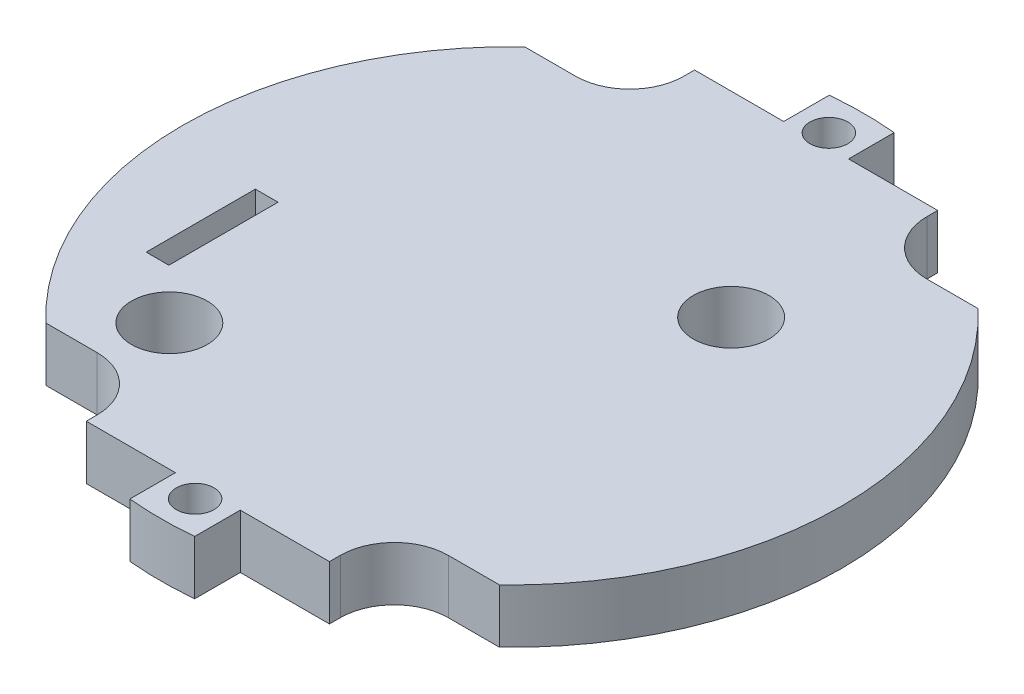
ISO-10303-21;
HEADER;
FILE_DESCRIPTION(('STEP AP214'),'2;1');
FILE_NAME('part.step','',(''),(''),'','','');
FILE_SCHEMA(('AUTOMOTIVE_DESIGN { 1 0 10303 214 1 1 1 1 }'));
ENDSEC;
DATA;
#1=APPLICATION_CONTEXT('core data for automotive mechanical design processes');
#2=APPLICATION_PROTOCOL_DEFINITION('international standard','automotive_design',2000,#1);
#3=PRODUCT_CONTEXT('',#1,'mechanical');
#4=PRODUCT('Part','Part','',(#3));
#5=PRODUCT_RELATED_PRODUCT_CATEGORY('part','',(#4));
#6=PRODUCT_DEFINITION_FORMATION('','',#4);
#7=PRODUCT_DEFINITION_CONTEXT('part definition',#1,'design');
#8=PRODUCT_DEFINITION('design','',#6,#7);
#9=PRODUCT_DEFINITION_SHAPE('','',#8);
#10=(LENGTH_UNIT() NAMED_UNIT(*) SI_UNIT(.MILLI.,.METRE.));
#11=(NAMED_UNIT(*) PLANE_ANGLE_UNIT() SI_UNIT($,.RADIAN.));
#12=(NAMED_UNIT(*) SI_UNIT($,.STERADIAN.) SOLID_ANGLE_UNIT());
#13=UNCERTAINTY_MEASURE_WITH_UNIT(LENGTH_MEASURE(1.E-05),#10,'distance_accuracy_value','');
#14=(GEOMETRIC_REPRESENTATION_CONTEXT(3) GLOBAL_UNCERTAINTY_ASSIGNED_CONTEXT((#13)) GLOBAL_UNIT_ASSIGNED_CONTEXT((#10,
#11,#12)) REPRESENTATION_CONTEXT('',''));
#15=CARTESIAN_POINT('',(0.,0.,0.));
#16=DIRECTION('',(0.,0.,1.));
#17=DIRECTION('',(1.,0.,0.));
#18=AXIS2_PLACEMENT_3D('',#15,#16,#17);
#19=CARTESIAN_POINT('',(0.,5.,22.1412422505688));
#20=DIRECTION('',(0.,0.,-1.));
#21=DIRECTION('',(-1.,0.,0.));
#22=AXIS2_PLACEMENT_3D('',#19,#20,#21);
#23=PLANE('',#22);
#24=DIRECTION('',(1.,0.,0.));
#25=VECTOR('',#24,1.);
#26=CARTESIAN_POINT('',(0.,0.,22.1412422505688));
#27=LINE('',#26,#25);
#28=CARTESIAN_POINT('',(-20.9765438431031,0.,22.1412422505688));
#29=VERTEX_POINT('',#28);
#30=CARTESIAN_POINT('',(-16.25,0.,22.1412422505688));
#31=VERTEX_POINT('',#30);
#32=EDGE_CURVE('E314',#29,#31,#27,.T.);
#33=ORIENTED_EDGE('',*,*,#32,.T.);
#34=DIRECTION('',(0.,-1.,0.));
#35=VECTOR('',#34,1.);
#36=CARTESIAN_POINT('',(-16.25,5.,22.1412422505688));
#37=LINE('',#36,#35);
#38=CARTESIAN_POINT('',(-16.25,5.,22.1412422505688));
#39=VERTEX_POINT('',#38);
#40=EDGE_CURVE('E416',#31,#39,#37,.F.);
#41=ORIENTED_EDGE('',*,*,#40,.T.);
#42=DIRECTION('',(1.,0.,0.));
#43=VECTOR('',#42,1.);
#44=CARTESIAN_POINT('',(0.,5.,22.1412422505688));
#45=LINE('',#44,#43);
#46=CARTESIAN_POINT('',(-20.9765438431031,5.,22.1412422505688));
#47=VERTEX_POINT('',#46);
#48=EDGE_CURVE('E258',#47,#39,#45,.T.);
#49=ORIENTED_EDGE('',*,*,#48,.F.);
#50=DIRECTION('',(0.,-1.,0.));
#51=VECTOR('',#50,1.);
#52=CARTESIAN_POINT('',(-20.9765438431031,5.,22.1412422505688));
#53=LINE('',#52,#51);
#54=EDGE_CURVE('E313',#47,#29,#53,.T.);
#55=ORIENTED_EDGE('',*,*,#54,.T.);
#56=EDGE_LOOP('',(#33,#41,#49,#55));
#57=FACE_BOUND('',#56,.T.);
#58=ADVANCED_FACE('F35',(#57),#23,.F.);
#59=CARTESIAN_POINT('',(-11.25,5.,0.));
#60=DIRECTION('',(-1.,0.,0.));
#61=DIRECTION('',(0.,0.,1.));
#62=AXIS2_PLACEMENT_3D('',#59,#60,#61);
#63=PLANE('',#62);
#64=DIRECTION('',(0.,0.,-1.));
#65=VECTOR('',#64,1.);
#66=CARTESIAN_POINT('',(-11.25,5.,0.));
#67=LINE('',#66,#65);
#68=CARTESIAN_POINT('',(-11.25,5.,28.1412422505688));
#69=VERTEX_POINT('',#68);
#70=CARTESIAN_POINT('',(-11.25,5.,27.1412422505688));
#71=VERTEX_POINT('',#70);
#72=EDGE_CURVE('E261',#69,#71,#67,.T.);
#73=ORIENTED_EDGE('',*,*,#72,.T.);
#74=DIRECTION('',(0.,-1.,0.));
#75=VECTOR('',#74,1.);
#76=CARTESIAN_POINT('',(-11.25,5.,27.1412422505688));
#77=LINE('',#76,#75);
#78=CARTESIAN_POINT('',(-11.25,0.,27.1412422505688));
#79=VERTEX_POINT('',#78);
#80=EDGE_CURVE('E413',#71,#79,#77,.T.);
#81=ORIENTED_EDGE('',*,*,#80,.T.);
#82=DIRECTION('',(0.,0.,-1.));
#83=VECTOR('',#82,1.);
#84=CARTESIAN_POINT('',(-11.25,0.,0.));
#85=LINE('',#84,#83);
#86=CARTESIAN_POINT('',(-11.25,0.,28.1412422505688));
#87=VERTEX_POINT('',#86);
#88=EDGE_CURVE('E317',#87,#79,#85,.T.);
#89=ORIENTED_EDGE('',*,*,#88,.F.);
#90=DIRECTION('',(0.,-1.,0.));
#91=VECTOR('',#90,1.);
#92=CARTESIAN_POINT('',(-11.25,5.,28.1412422505688));
#93=LINE('',#92,#91);
#94=EDGE_CURVE('E406',#69,#87,#93,.T.);
#95=ORIENTED_EDGE('',*,*,#94,.F.);
#96=EDGE_LOOP('',(#73,#81,#89,#95));
#97=FACE_BOUND('',#96,.T.);
#98=ADVANCED_FACE('F511',(#97),#63,.T.);
#99=CARTESIAN_POINT('',(0.,5.,28.1412422505688));
#100=DIRECTION('',(0.,0.,1.));
#101=DIRECTION('',(1.,0.,0.));
#102=AXIS2_PLACEMENT_3D('',#99,#100,#101);
#103=PLANE('',#102);
#104=DIRECTION('',(-1.,0.,0.));
#105=VECTOR('',#104,1.);
#106=CARTESIAN_POINT('',(0.,0.,28.1412422505688));
#107=LINE('',#106,#105);
#108=CARTESIAN_POINT('',(-2.99999999999999,0.,28.1412422505688));
#109=VERTEX_POINT('',#108);
#110=EDGE_CURVE('E322',#109,#87,#107,.T.);
#111=ORIENTED_EDGE('',*,*,#110,.F.);
#112=DIRECTION('',(0.,-1.,0.));
#113=VECTOR('',#112,1.);
#114=CARTESIAN_POINT('',(-2.99999999999999,5.,28.1412422505688));
#115=LINE('',#114,#113);
#116=CARTESIAN_POINT('',(-2.99999999999999,5.,28.1412422505688));
#117=VERTEX_POINT('',#116);
#118=EDGE_CURVE('E404',#117,#109,#115,.T.);
#119=ORIENTED_EDGE('',*,*,#118,.F.);
#120=DIRECTION('',(-1.,0.,0.));
#121=VECTOR('',#120,1.);
#122=CARTESIAN_POINT('',(0.,5.,28.1412422505688));
#123=LINE('',#122,#121);
#124=EDGE_CURVE('E266',#117,#69,#123,.T.);
#125=ORIENTED_EDGE('',*,*,#124,.T.);
#126=ORIENTED_EDGE('',*,*,#94,.T.);
#127=EDGE_LOOP('',(#111,#119,#125,#126));
#128=FACE_BOUND('',#127,.T.);
#129=ADVANCED_FACE('F516',(#128),#103,.T.);
#130=CARTESIAN_POINT('',(-3.,5.,0.));
#131=DIRECTION('',(-1.,0.,0.));
#132=DIRECTION('',(0.,0.,1.));
#133=AXIS2_PLACEMENT_3D('',#130,#131,#132);
#134=PLANE('',#133);
#135=DIRECTION('',(0.,0.,-1.));
#136=VECTOR('',#135,1.);
#137=CARTESIAN_POINT('',(-3.,0.,0.));
#138=LINE('',#137,#136);
#139=CARTESIAN_POINT('',(-2.99999999999998,0.,32.3612422505688));
#140=VERTEX_POINT('',#139);
#141=EDGE_CURVE('E325',#140,#109,#138,.T.);
#142=ORIENTED_EDGE('',*,*,#141,.F.);
#143=DIRECTION('',(0.,-1.,0.));
#144=VECTOR('',#143,1.);
#145=CARTESIAN_POINT('',(-2.99999999999998,5.,32.3612422505688));
#146=LINE('',#145,#144);
#147=CARTESIAN_POINT('',(-2.99999999999998,5.,32.3612422505688));
#148=VERTEX_POINT('',#147);
#149=EDGE_CURVE('E402',#148,#140,#146,.T.);
#150=ORIENTED_EDGE('',*,*,#149,.F.);
#151=DIRECTION('',(0.,0.,-1.));
#152=VECTOR('',#151,1.);
#153=CARTESIAN_POINT('',(-3.,5.,0.));
#154=LINE('',#153,#152);
#155=EDGE_CURVE('E269',#148,#117,#154,.T.);
#156=ORIENTED_EDGE('',*,*,#155,.T.);
#157=ORIENTED_EDGE('',*,*,#118,.T.);
#158=EDGE_LOOP('',(#142,#150,#156,#157));
#159=FACE_BOUND('',#158,.T.);
#160=ADVANCED_FACE('F520',(#159),#134,.T.);
#161=CARTESIAN_POINT('',(0.,5.,0.));
#162=DIRECTION('',(0.,-1.,0.));
#163=DIRECTION('',(0.,0.,-1.));
#164=AXIS2_PLACEMENT_3D('',#161,#162,#163);
#165=CYLINDRICAL_SURFACE('',#164,32.5);
#166=CARTESIAN_POINT('',(0.,0.,0.));
#167=DIRECTION('',(0.,1.,0.));
#168=DIRECTION('',(0.,0.,1.));
#169=AXIS2_PLACEMENT_3D('',#166,#167,#168);
#170=CIRCLE('',#169,32.5);
#171=CARTESIAN_POINT('',(3.,0.,32.3612422505688));
#172=VERTEX_POINT('',#171);
#173=EDGE_CURVE('E328',#140,#172,#170,.T.);
#174=ORIENTED_EDGE('',*,*,#173,.T.);
#175=DIRECTION('',(0.,-1.,0.));
#176=VECTOR('',#175,1.);
#177=CARTESIAN_POINT('',(3.,5.,32.3612422505688));
#178=LINE('',#177,#176);
#179=CARTESIAN_POINT('',(3.,5.,32.3612422505688));
#180=VERTEX_POINT('',#179);
#181=EDGE_CURVE('E399',#180,#172,#178,.T.);
#182=ORIENTED_EDGE('',*,*,#181,.F.);
#183=CARTESIAN_POINT('',(0.,5.,0.));
#184=DIRECTION('',(0.,1.,0.));
#185=DIRECTION('',(0.,0.,1.));
#186=AXIS2_PLACEMENT_3D('',#183,#184,#185);
#187=CIRCLE('',#186,32.5);
#188=EDGE_CURVE('E272',#148,#180,#187,.T.);
#189=ORIENTED_EDGE('',*,*,#188,.F.);
#190=ORIENTED_EDGE('',*,*,#149,.T.);
#191=EDGE_LOOP('',(#174,#182,#189,#190));
#192=FACE_BOUND('',#191,.T.);
#193=ADVANCED_FACE('F524',(#192),#165,.T.);
#194=CARTESIAN_POINT('',(3.00000000000001,5.,0.));
#195=DIRECTION('',(-1.,0.,0.));
#196=DIRECTION('',(0.,0.,1.));
#197=AXIS2_PLACEMENT_3D('',#194,#195,#196);
#198=PLANE('',#197);
#199=DIRECTION('',(0.,0.,-1.));
#200=VECTOR('',#199,1.);
#201=CARTESIAN_POINT('',(3.00000000000001,0.,0.));
#202=LINE('',#201,#200);
#203=CARTESIAN_POINT('',(3.,0.,28.1412422505688));
#204=VERTEX_POINT('',#203);
#205=EDGE_CURVE('E330',#172,#204,#202,.T.);
#206=ORIENTED_EDGE('',*,*,#205,.T.);
#207=DIRECTION('',(0.,-1.,0.));
#208=VECTOR('',#207,1.);
#209=CARTESIAN_POINT('',(3.,5.,28.1412422505688));
#210=LINE('',#209,#208);
#211=CARTESIAN_POINT('',(3.,5.,28.1412422505688));
#212=VERTEX_POINT('',#211);
#213=EDGE_CURVE('E396',#212,#204,#210,.T.);
#214=ORIENTED_EDGE('',*,*,#213,.F.);
#215=DIRECTION('',(0.,0.,-1.));
#216=VECTOR('',#215,1.);
#217=CARTESIAN_POINT('',(3.00000000000001,5.,0.));
#218=LINE('',#217,#216);
#219=EDGE_CURVE('E274',#180,#212,#218,.T.);
#220=ORIENTED_EDGE('',*,*,#219,.F.);
#221=ORIENTED_EDGE('',*,*,#181,.T.);
#222=EDGE_LOOP('',(#206,#214,#220,#221));
#223=FACE_BOUND('',#222,.T.);
#224=ADVANCED_FACE('F530',(#223),#198,.F.);
#225=CARTESIAN_POINT('',(0.,5.,28.1412422505688));
#226=DIRECTION('',(0.,0.,-1.));
#227=DIRECTION('',(-1.,0.,0.));
#228=AXIS2_PLACEMENT_3D('',#225,#226,#227);
#229=PLANE('',#228);
#230=DIRECTION('',(1.,0.,0.));
#231=VECTOR('',#230,1.);
#232=CARTESIAN_POINT('',(0.,0.,28.1412422505688));
#233=LINE('',#232,#231);
#234=CARTESIAN_POINT('',(11.25,0.,28.1412422505688));
#235=VERTEX_POINT('',#234);
#236=EDGE_CURVE('E332',#204,#235,#233,.T.);
#237=ORIENTED_EDGE('',*,*,#236,.T.);
#238=DIRECTION('',(0.,-1.,0.));
#239=VECTOR('',#238,1.);
#240=CARTESIAN_POINT('',(11.25,5.,28.1412422505688));
#241=LINE('',#240,#239);
#242=CARTESIAN_POINT('',(11.25,5.,28.1412422505688));
#243=VERTEX_POINT('',#242);
#244=EDGE_CURVE('E393',#243,#235,#241,.T.);
#245=ORIENTED_EDGE('',*,*,#244,.F.);
#246=DIRECTION('',(1.,0.,0.));
#247=VECTOR('',#246,1.);
#248=CARTESIAN_POINT('',(0.,5.,28.1412422505688));
#249=LINE('',#248,#247);
#250=EDGE_CURVE('E276',#212,#243,#249,.T.);
#251=ORIENTED_EDGE('',*,*,#250,.F.);
#252=ORIENTED_EDGE('',*,*,#213,.T.);
#253=EDGE_LOOP('',(#237,#245,#251,#252));
#254=FACE_BOUND('',#253,.T.);
#255=ADVANCED_FACE('F534',(#254),#229,.F.);
#256=CARTESIAN_POINT('',(11.25,5.,0.));
#257=DIRECTION('',(-1.,0.,0.));
#258=DIRECTION('',(0.,0.,1.));
#259=AXIS2_PLACEMENT_3D('',#256,#257,#258);
#260=PLANE('',#259);
#261=DIRECTION('',(0.,0.,-1.));
#262=VECTOR('',#261,1.);
#263=CARTESIAN_POINT('',(11.25,0.,0.));
#264=LINE('',#263,#262);
#265=CARTESIAN_POINT('',(11.25,0.,27.1412422505688));
#266=VERTEX_POINT('',#265);
#267=EDGE_CURVE('E334',#235,#266,#264,.T.);
#268=ORIENTED_EDGE('',*,*,#267,.T.);
#269=DIRECTION('',(0.,-1.,0.));
#270=VECTOR('',#269,1.);
#271=CARTESIAN_POINT('',(11.25,5.,27.1412422505688));
#272=LINE('',#271,#270);
#273=CARTESIAN_POINT('',(11.25,5.,27.1412422505688));
#274=VERTEX_POINT('',#273);
#275=EDGE_CURVE('E411',#266,#274,#272,.F.);
#276=ORIENTED_EDGE('',*,*,#275,.T.);
#277=DIRECTION('',(0.,0.,-1.));
#278=VECTOR('',#277,1.);
#279=CARTESIAN_POINT('',(11.25,5.,0.));
#280=LINE('',#279,#278);
#281=EDGE_CURVE('E278',#243,#274,#280,.T.);
#282=ORIENTED_EDGE('',*,*,#281,.F.);
#283=ORIENTED_EDGE('',*,*,#244,.T.);
#284=EDGE_LOOP('',(#268,#276,#282,#283));
#285=FACE_BOUND('',#284,.T.);
#286=ADVANCED_FACE('F538',(#285),#260,.F.);
#287=CARTESIAN_POINT('',(16.25,5.,22.1412422505688));
#288=VERTEX_POINT('',#287);
#289=CARTESIAN_POINT('',(20.9765438431031,5.,22.1412422505688));
#290=VERTEX_POINT('',#289);
#291=EDGE_CURVE('E263',#288,#290,#45,.T.);
#292=ORIENTED_EDGE('',*,*,#291,.F.);
#293=DIRECTION('',(0.,-1.,0.));
#294=VECTOR('',#293,1.);
#295=CARTESIAN_POINT('',(16.25,0.,22.1412422505688));
#296=LINE('',#295,#294);
#297=CARTESIAN_POINT('',(16.25,0.,22.1412422505688));
#298=VERTEX_POINT('',#297);
#299=EDGE_CURVE('E408',#288,#298,#296,.T.);
#300=ORIENTED_EDGE('',*,*,#299,.T.);
#301=CARTESIAN_POINT('',(20.9765438431031,0.,22.1412422505688));
#302=VERTEX_POINT('',#301);
#303=EDGE_CURVE('E319',#298,#302,#27,.T.);
#304=ORIENTED_EDGE('',*,*,#303,.T.);
#305=DIRECTION('',(0.,-1.,0.));
#306=VECTOR('',#305,1.);
#307=CARTESIAN_POINT('',(20.9765438431031,5.,22.1412422505688));
#308=LINE('',#307,#306);
#309=EDGE_CURVE('E390',#290,#302,#308,.T.);
#310=ORIENTED_EDGE('',*,*,#309,.F.);
#311=EDGE_LOOP('',(#292,#300,#304,#310));
#312=FACE_BOUND('',#311,.T.);
#313=ADVANCED_FACE('F547',(#312),#23,.F.);
#314=CARTESIAN_POINT('',(0.,5.,0.));
#315=DIRECTION('',(0.,-1.,0.));
#316=DIRECTION('',(0.,0.,-1.));
#317=AXIS2_PLACEMENT_3D('',#314,#315,#316);
#318=CYLINDRICAL_SURFACE('',#317,30.5);
#319=CARTESIAN_POINT('',(0.,0.,0.));
#320=DIRECTION('',(0.,1.,0.));
#321=DIRECTION('',(0.,0.,1.));
#322=AXIS2_PLACEMENT_3D('',#319,#320,#321);
#323=CIRCLE('',#322,30.5);
#324=CARTESIAN_POINT('',(20.9765438431031,0.,-22.1412422505688));
#325=VERTEX_POINT('',#324);
#326=EDGE_CURVE('E337',#302,#325,#323,.T.);
#327=ORIENTED_EDGE('',*,*,#326,.T.);
#328=DIRECTION('',(0.,-1.,0.));
#329=VECTOR('',#328,1.);
#330=CARTESIAN_POINT('',(20.9765438431031,5.,-22.1412422505688));
#331=LINE('',#330,#329);
#332=CARTESIAN_POINT('',(20.9765438431031,5.,-22.1412422505688));
#333=VERTEX_POINT('',#332);
#334=EDGE_CURVE('E387',#333,#325,#331,.T.);
#335=ORIENTED_EDGE('',*,*,#334,.F.);
#336=CARTESIAN_POINT('',(0.,5.,0.));
#337=DIRECTION('',(0.,1.,0.));
#338=DIRECTION('',(0.,0.,1.));
#339=AXIS2_PLACEMENT_3D('',#336,#337,#338);
#340=CIRCLE('',#339,30.5);
#341=EDGE_CURVE('E281',#290,#333,#340,.T.);
#342=ORIENTED_EDGE('',*,*,#341,.F.);
#343=ORIENTED_EDGE('',*,*,#309,.T.);
#344=EDGE_LOOP('',(#327,#335,#342,#343));
#345=FACE_BOUND('',#344,.T.);
#346=ADVANCED_FACE('F550',(#345),#318,.T.);
#347=CARTESIAN_POINT('',(0.,5.,-22.1412422505688));
#348=DIRECTION('',(0.,0.,-1.));
#349=DIRECTION('',(-1.,0.,0.));
#350=AXIS2_PLACEMENT_3D('',#347,#348,#349);
#351=PLANE('',#350);
#352=DIRECTION('',(1.,0.,0.));
#353=VECTOR('',#352,1.);
#354=CARTESIAN_POINT('',(0.,0.,-22.1412422505688));
#355=LINE('',#354,#353);
#356=CARTESIAN_POINT('',(16.25,0.,-22.1412422505688));
#357=VERTEX_POINT('',#356);
#358=EDGE_CURVE('E340',#357,#325,#355,.T.);
#359=ORIENTED_EDGE('',*,*,#358,.F.);
#360=DIRECTION('',(0.,-1.,0.));
#361=VECTOR('',#360,1.);
#362=CARTESIAN_POINT('',(16.25,5.,-22.1412422505688));
#363=LINE('',#362,#361);
#364=CARTESIAN_POINT('',(16.25,5.,-22.1412422505688));
#365=VERTEX_POINT('',#364);
#366=EDGE_CURVE('E426',#357,#365,#363,.F.);
#367=ORIENTED_EDGE('',*,*,#366,.T.);
#368=DIRECTION('',(1.,0.,0.));
#369=VECTOR('',#368,1.);
#370=CARTESIAN_POINT('',(0.,5.,-22.1412422505688));
#371=LINE('',#370,#369);
#372=EDGE_CURVE('E284',#365,#333,#371,.T.);
#373=ORIENTED_EDGE('',*,*,#372,.T.);
#374=ORIENTED_EDGE('',*,*,#334,.T.);
#375=EDGE_LOOP('',(#359,#367,#373,#374));
#376=FACE_BOUND('',#375,.T.);
#377=ADVANCED_FACE('F448',(#376),#351,.T.);
#378=CARTESIAN_POINT('',(11.25,5.,0.));
#379=DIRECTION('',(1.,0.,0.));
#380=DIRECTION('',(0.,0.,-1.));
#381=AXIS2_PLACEMENT_3D('',#378,#379,#380);
#382=PLANE('',#381);
#383=DIRECTION('',(0.,0.,1.));
#384=VECTOR('',#383,1.);
#385=CARTESIAN_POINT('',(11.25,5.,0.));
#386=LINE('',#385,#384);
#387=CARTESIAN_POINT('',(11.25,5.,-28.1412422505688));
#388=VERTEX_POINT('',#387);
#389=CARTESIAN_POINT('',(11.25,5.,-27.1412422505688));
#390=VERTEX_POINT('',#389);
#391=EDGE_CURVE('E286',#388,#390,#386,.T.);
#392=ORIENTED_EDGE('',*,*,#391,.T.);
#393=DIRECTION('',(0.,-1.,0.));
#394=VECTOR('',#393,1.);
#395=CARTESIAN_POINT('',(11.25,0.,-27.1412422505688));
#396=LINE('',#395,#394);
#397=CARTESIAN_POINT('',(11.25,0.,-27.1412422505688));
#398=VERTEX_POINT('',#397);
#399=EDGE_CURVE('E423',#390,#398,#396,.T.);
#400=ORIENTED_EDGE('',*,*,#399,.T.);
#401=DIRECTION('',(0.,0.,1.));
#402=VECTOR('',#401,1.);
#403=CARTESIAN_POINT('',(11.25,0.,0.));
#404=LINE('',#403,#402);
#405=CARTESIAN_POINT('',(11.25,0.,-28.1412422505688));
#406=VERTEX_POINT('',#405);
#407=EDGE_CURVE('E342',#406,#398,#404,.T.);
#408=ORIENTED_EDGE('',*,*,#407,.F.);
#409=DIRECTION('',(0.,-1.,0.));
#410=VECTOR('',#409,1.);
#411=CARTESIAN_POINT('',(11.25,5.,-28.1412422505688));
#412=LINE('',#411,#410);
#413=EDGE_CURVE('E385',#388,#406,#412,.T.);
#414=ORIENTED_EDGE('',*,*,#413,.F.);
#415=EDGE_LOOP('',(#392,#400,#408,#414));
#416=FACE_BOUND('',#415,.T.);
#417=ADVANCED_FACE('F458',(#416),#382,.T.);
#418=CARTESIAN_POINT('',(0.,5.,-28.1412422505688));
#419=DIRECTION('',(0.,0.,-1.));
#420=DIRECTION('',(-1.,0.,0.));
#421=AXIS2_PLACEMENT_3D('',#418,#419,#420);
#422=PLANE('',#421);
#423=DIRECTION('',(1.,0.,0.));
#424=VECTOR('',#423,1.);
#425=CARTESIAN_POINT('',(0.,0.,-28.1412422505688));
#426=LINE('',#425,#424);
#427=CARTESIAN_POINT('',(3.,0.,-28.1412422505688));
#428=VERTEX_POINT('',#427);
#429=EDGE_CURVE('E346',#428,#406,#426,.T.);
#430=ORIENTED_EDGE('',*,*,#429,.F.);
#431=DIRECTION('',(0.,-1.,0.));
#432=VECTOR('',#431,1.);
#433=CARTESIAN_POINT('',(3.,5.,-28.1412422505688));
#434=LINE('',#433,#432);
#435=CARTESIAN_POINT('',(3.,5.,-28.1412422505688));
#436=VERTEX_POINT('',#435);
#437=EDGE_CURVE('E383',#436,#428,#434,.T.);
#438=ORIENTED_EDGE('',*,*,#437,.F.);
#439=DIRECTION('',(1.,0.,0.));
#440=VECTOR('',#439,1.);
#441=CARTESIAN_POINT('',(0.,5.,-28.1412422505688));
#442=LINE('',#441,#440);
#443=EDGE_CURVE('E290',#436,#388,#442,.T.);
#444=ORIENTED_EDGE('',*,*,#443,.T.);
#445=ORIENTED_EDGE('',*,*,#413,.T.);
#446=EDGE_LOOP('',(#430,#438,#444,#445));
#447=FACE_BOUND('',#446,.T.);
#448=ADVANCED_FACE('F461',(#447),#422,.T.);
#449=CARTESIAN_POINT('',(3.00000000000001,5.,0.));
#450=DIRECTION('',(1.,0.,0.));
#451=DIRECTION('',(0.,0.,-1.));
#452=AXIS2_PLACEMENT_3D('',#449,#450,#451);
#453=PLANE('',#452);
#454=DIRECTION('',(0.,0.,1.));
#455=VECTOR('',#454,1.);
#456=CARTESIAN_POINT('',(3.00000000000001,0.,0.));
#457=LINE('',#456,#455);
#458=CARTESIAN_POINT('',(3.,0.,-32.3612422505688));
#459=VERTEX_POINT('',#458);
#460=EDGE_CURVE('E349',#459,#428,#457,.T.);
#461=ORIENTED_EDGE('',*,*,#460,.F.);
#462=DIRECTION('',(0.,-1.,0.));
#463=VECTOR('',#462,1.);
#464=CARTESIAN_POINT('',(3.,5.,-32.3612422505688));
#465=LINE('',#464,#463);
#466=CARTESIAN_POINT('',(3.,5.,-32.3612422505688));
#467=VERTEX_POINT('',#466);
#468=EDGE_CURVE('E381',#467,#459,#465,.T.);
#469=ORIENTED_EDGE('',*,*,#468,.F.);
#470=DIRECTION('',(0.,0.,1.));
#471=VECTOR('',#470,1.);
#472=CARTESIAN_POINT('',(3.00000000000001,5.,0.));
#473=LINE('',#472,#471);
#474=EDGE_CURVE('E293',#467,#436,#473,.T.);
#475=ORIENTED_EDGE('',*,*,#474,.T.);
#476=ORIENTED_EDGE('',*,*,#437,.T.);
#477=EDGE_LOOP('',(#461,#469,#475,#476));
#478=FACE_BOUND('',#477,.T.);
#479=ADVANCED_FACE('F465',(#478),#453,.T.);
#480=CARTESIAN_POINT('',(0.,5.,0.));
#481=DIRECTION('',(0.,-1.,0.));
#482=DIRECTION('',(0.,0.,-1.));
#483=AXIS2_PLACEMENT_3D('',#480,#481,#482);
#484=CYLINDRICAL_SURFACE('',#483,32.5);
#485=CARTESIAN_POINT('',(0.,0.,0.));
#486=DIRECTION('',(0.,1.,0.));
#487=DIRECTION('',(0.,0.,1.));
#488=AXIS2_PLACEMENT_3D('',#485,#486,#487);
#489=CIRCLE('',#488,32.5);
#490=CARTESIAN_POINT('',(-2.99999999999998,0.,-32.3612422505688));
#491=VERTEX_POINT('',#490);
#492=EDGE_CURVE('E352',#459,#491,#489,.T.);
#493=ORIENTED_EDGE('',*,*,#492,.T.);
#494=DIRECTION('',(0.,-1.,0.));
#495=VECTOR('',#494,1.);
#496=CARTESIAN_POINT('',(-2.99999999999998,5.,-32.3612422505688));
#497=LINE('',#496,#495);
#498=CARTESIAN_POINT('',(-2.99999999999998,5.,-32.3612422505688));
#499=VERTEX_POINT('',#498);
#500=EDGE_CURVE('E378',#499,#491,#497,.T.);
#501=ORIENTED_EDGE('',*,*,#500,.F.);
#502=CARTESIAN_POINT('',(0.,5.,0.));
#503=DIRECTION('',(0.,1.,0.));
#504=DIRECTION('',(0.,0.,1.));
#505=AXIS2_PLACEMENT_3D('',#502,#503,#504);
#506=CIRCLE('',#505,32.5);
#507=EDGE_CURVE('E296',#467,#499,#506,.T.);
#508=ORIENTED_EDGE('',*,*,#507,.F.);
#509=ORIENTED_EDGE('',*,*,#468,.T.);
#510=EDGE_LOOP('',(#493,#501,#508,#509));
#511=FACE_BOUND('',#510,.T.);
#512=ADVANCED_FACE('F470',(#511),#484,.T.);
#513=CARTESIAN_POINT('',(-3.,5.,0.));
#514=DIRECTION('',(1.,0.,0.));
#515=DIRECTION('',(0.,0.,-1.));
#516=AXIS2_PLACEMENT_3D('',#513,#514,#515);
#517=PLANE('',#516);
#518=DIRECTION('',(0.,0.,1.));
#519=VECTOR('',#518,1.);
#520=CARTESIAN_POINT('',(-3.,0.,0.));
#521=LINE('',#520,#519);
#522=CARTESIAN_POINT('',(-2.99999999999999,0.,-28.1412422505688));
#523=VERTEX_POINT('',#522);
#524=EDGE_CURVE('E354',#491,#523,#521,.T.);
#525=ORIENTED_EDGE('',*,*,#524,.T.);
#526=DIRECTION('',(0.,-1.,0.));
#527=VECTOR('',#526,1.);
#528=CARTESIAN_POINT('',(-2.99999999999999,5.,-28.1412422505688));
#529=LINE('',#528,#527);
#530=CARTESIAN_POINT('',(-2.99999999999999,5.,-28.1412422505688));
#531=VERTEX_POINT('',#530);
#532=EDGE_CURVE('E375',#531,#523,#529,.T.);
#533=ORIENTED_EDGE('',*,*,#532,.F.);
#534=DIRECTION('',(0.,0.,1.));
#535=VECTOR('',#534,1.);
#536=CARTESIAN_POINT('',(-3.,5.,0.));
#537=LINE('',#536,#535);
#538=EDGE_CURVE('E298',#499,#531,#537,.T.);
#539=ORIENTED_EDGE('',*,*,#538,.F.);
#540=ORIENTED_EDGE('',*,*,#500,.T.);
#541=EDGE_LOOP('',(#525,#533,#539,#540));
#542=FACE_BOUND('',#541,.T.);
#543=ADVANCED_FACE('F476',(#542),#517,.F.);
#544=CARTESIAN_POINT('',(0.,5.,-28.1412422505688));
#545=DIRECTION('',(0.,0.,1.));
#546=DIRECTION('',(1.,0.,0.));
#547=AXIS2_PLACEMENT_3D('',#544,#545,#546);
#548=PLANE('',#547);
#549=DIRECTION('',(-1.,0.,0.));
#550=VECTOR('',#549,1.);
#551=CARTESIAN_POINT('',(0.,0.,-28.1412422505688));
#552=LINE('',#551,#550);
#553=CARTESIAN_POINT('',(-11.25,0.,-28.1412422505688));
#554=VERTEX_POINT('',#553);
#555=EDGE_CURVE('E356',#523,#554,#552,.T.);
#556=ORIENTED_EDGE('',*,*,#555,.T.);
#557=DIRECTION('',(0.,-1.,0.));
#558=VECTOR('',#557,1.);
#559=CARTESIAN_POINT('',(-11.25,5.,-28.1412422505688));
#560=LINE('',#559,#558);
#561=CARTESIAN_POINT('',(-11.25,5.,-28.1412422505688));
#562=VERTEX_POINT('',#561);
#563=EDGE_CURVE('E372',#562,#554,#560,.T.);
#564=ORIENTED_EDGE('',*,*,#563,.F.);
#565=DIRECTION('',(-1.,0.,0.));
#566=VECTOR('',#565,1.);
#567=CARTESIAN_POINT('',(0.,5.,-28.1412422505688));
#568=LINE('',#567,#566);
#569=EDGE_CURVE('E300',#531,#562,#568,.T.);
#570=ORIENTED_EDGE('',*,*,#569,.F.);
#571=ORIENTED_EDGE('',*,*,#532,.T.);
#572=EDGE_LOOP('',(#556,#564,#570,#571));
#573=FACE_BOUND('',#572,.T.);
#574=ADVANCED_FACE('F480',(#573),#548,.F.);
#575=CARTESIAN_POINT('',(-11.25,5.,0.));
#576=DIRECTION('',(1.,0.,0.));
#577=DIRECTION('',(0.,0.,-1.));
#578=AXIS2_PLACEMENT_3D('',#575,#576,#577);
#579=PLANE('',#578);
#580=DIRECTION('',(0.,0.,1.));
#581=VECTOR('',#580,1.);
#582=CARTESIAN_POINT('',(-11.25,0.,0.));
#583=LINE('',#582,#581);
#584=CARTESIAN_POINT('',(-11.25,0.,-27.1412422505688));
#585=VERTEX_POINT('',#584);
#586=EDGE_CURVE('E358',#554,#585,#583,.T.);
#587=ORIENTED_EDGE('',*,*,#586,.T.);
#588=DIRECTION('',(0.,-1.,0.));
#589=VECTOR('',#588,1.);
#590=CARTESIAN_POINT('',(-11.25,5.,-27.1412422505688));
#591=LINE('',#590,#589);
#592=CARTESIAN_POINT('',(-11.25,5.,-27.1412422505688));
#593=VERTEX_POINT('',#592);
#594=EDGE_CURVE('E421',#585,#593,#591,.F.);
#595=ORIENTED_EDGE('',*,*,#594,.T.);
#596=DIRECTION('',(0.,0.,1.));
#597=VECTOR('',#596,1.);
#598=CARTESIAN_POINT('',(-11.25,5.,0.));
#599=LINE('',#598,#597);
#600=EDGE_CURVE('E302',#562,#593,#599,.T.);
#601=ORIENTED_EDGE('',*,*,#600,.F.);
#602=ORIENTED_EDGE('',*,*,#563,.T.);
#603=EDGE_LOOP('',(#587,#595,#601,#602));
#604=FACE_BOUND('',#603,.T.);
#605=ADVANCED_FACE('F484',(#604),#579,.F.);
#606=CARTESIAN_POINT('',(-20.9765438431031,5.,-22.1412422505688));
#607=VERTEX_POINT('',#606);
#608=CARTESIAN_POINT('',(-16.25,5.,-22.1412422505688));
#609=VERTEX_POINT('',#608);
#610=EDGE_CURVE('E287',#607,#609,#371,.T.);
#611=ORIENTED_EDGE('',*,*,#610,.T.);
#612=DIRECTION('',(0.,-1.,0.));
#613=VECTOR('',#612,1.);
#614=CARTESIAN_POINT('',(-16.25,5.,-22.1412422505688));
#615=LINE('',#614,#613);
#616=CARTESIAN_POINT('',(-16.25,0.,-22.1412422505688));
#617=VERTEX_POINT('',#616);
#618=EDGE_CURVE('E418',#609,#617,#615,.T.);
#619=ORIENTED_EDGE('',*,*,#618,.T.);
#620=CARTESIAN_POINT('',(-20.9765438431031,0.,-22.1412422505688));
#621=VERTEX_POINT('',#620);
#622=EDGE_CURVE('E343',#621,#617,#355,.T.);
#623=ORIENTED_EDGE('',*,*,#622,.F.);
#624=DIRECTION('',(0.,-1.,0.));
#625=VECTOR('',#624,1.);
#626=CARTESIAN_POINT('',(-20.9765438431031,5.,-22.1412422505688));
#627=LINE('',#626,#625);
#628=EDGE_CURVE('E370',#607,#621,#627,.T.);
#629=ORIENTED_EDGE('',*,*,#628,.F.);
#630=EDGE_LOOP('',(#611,#619,#623,#629));
#631=FACE_BOUND('',#630,.T.);
#632=ADVANCED_FACE('F495',(#631),#351,.T.);
#633=CARTESIAN_POINT('',(0.,5.,-29.32));
#634=DIRECTION('',(0.,-1.,0.));
#635=DIRECTION('',(0.,0.,-1.));
#636=AXIS2_PLACEMENT_3D('',#633,#634,#635);
#637=CYLINDRICAL_SURFACE('',#636,1.75);
#638=CARTESIAN_POINT('',(0.,5.,-29.32));
#639=DIRECTION('',(0.,1.,0.));
#640=DIRECTION('',(0.,0.,1.));
#641=AXIS2_PLACEMENT_3D('',#638,#639,#640);
#642=CIRCLE('',#641,1.75);
#643=CARTESIAN_POINT('',(0.,5.,-27.57));
#644=VERTEX_POINT('',#643);
#645=EDGE_CURVE('E307',#644,#644,#642,.T.);
#646=ORIENTED_EDGE('',*,*,#645,.T.);
#647=EDGE_LOOP('',(#646));
#648=FACE_BOUND('',#647,.T.);
#649=CARTESIAN_POINT('',(0.,0.,-29.32));
#650=DIRECTION('',(0.,1.,0.));
#651=DIRECTION('',(0.,0.,1.));
#652=AXIS2_PLACEMENT_3D('',#649,#650,#651);
#653=CIRCLE('',#652,1.75);
#654=CARTESIAN_POINT('',(0.,0.,-27.57));
#655=VERTEX_POINT('',#654);
#656=EDGE_CURVE('E363',#655,#655,#653,.T.);
#657=ORIENTED_EDGE('',*,*,#656,.F.);
#658=EDGE_LOOP('',(#657));
#659=FACE_BOUND('',#658,.T.);
#660=ADVANCED_FACE('F610',(#648,#659),#637,.F.);
#661=CARTESIAN_POINT('',(0.,5.,0.));
#662=DIRECTION('',(0.,-1.,0.));
#663=DIRECTION('',(0.,0.,-1.));
#664=AXIS2_PLACEMENT_3D('',#661,#662,#663);
#665=CYLINDRICAL_SURFACE('',#664,30.5);
#666=CARTESIAN_POINT('',(0.,0.,0.));
#667=DIRECTION('',(0.,1.,0.));
#668=DIRECTION('',(0.,0.,1.));
#669=AXIS2_PLACEMENT_3D('',#666,#667,#668);
#670=CIRCLE('',#669,30.5);
#671=EDGE_CURVE('E361',#621,#29,#670,.T.);
#672=ORIENTED_EDGE('',*,*,#671,.T.);
#673=ORIENTED_EDGE('',*,*,#54,.F.);
#674=CARTESIAN_POINT('',(0.,5.,0.));
#675=DIRECTION('',(0.,1.,0.));
#676=DIRECTION('',(0.,0.,1.));
#677=AXIS2_PLACEMENT_3D('',#674,#675,#676);
#678=CIRCLE('',#677,30.5);
#679=EDGE_CURVE('E305',#607,#47,#678,.T.);
#680=ORIENTED_EDGE('',*,*,#679,.F.);
#681=ORIENTED_EDGE('',*,*,#628,.T.);
#682=EDGE_LOOP('',(#672,#673,#680,#681));
#683=FACE_BOUND('',#682,.T.);
#684=ADVANCED_FACE('F499',(#683),#665,.T.);
#685=CARTESIAN_POINT('',(0.,5.,29.32));
#686=DIRECTION('',(0.,-1.,0.));
#687=DIRECTION('',(0.,0.,-1.));
#688=AXIS2_PLACEMENT_3D('',#685,#686,#687);
#689=CYLINDRICAL_SURFACE('',#688,1.75);
#690=CARTESIAN_POINT('',(0.,5.,29.32));
#691=DIRECTION('',(0.,1.,0.));
#692=DIRECTION('',(0.,0.,1.));
#693=AXIS2_PLACEMENT_3D('',#690,#691,#692);
#694=CIRCLE('',#693,1.75);
#695=CARTESIAN_POINT('',(0.,5.,31.07));
#696=VERTEX_POINT('',#695);
#697=EDGE_CURVE('E310',#696,#696,#694,.T.);
#698=ORIENTED_EDGE('',*,*,#697,.T.);
#699=EDGE_LOOP('',(#698));
#700=FACE_BOUND('',#699,.T.);
#701=CARTESIAN_POINT('',(0.,0.,29.32));
#702=DIRECTION('',(0.,1.,0.));
#703=DIRECTION('',(0.,0.,1.));
#704=AXIS2_PLACEMENT_3D('',#701,#702,#703);
#705=CIRCLE('',#704,1.75);
#706=CARTESIAN_POINT('',(0.,0.,31.07));
#707=VERTEX_POINT('',#706);
#708=EDGE_CURVE('E262',#707,#707,#705,.T.);
#709=ORIENTED_EDGE('',*,*,#708,.F.);
#710=EDGE_LOOP('',(#709));
#711=FACE_BOUND('',#710,.T.);
#712=ADVANCED_FACE('F602',(#700,#711),#689,.F.);
#713=CARTESIAN_POINT('',(0.,5.,0.));
#714=DIRECTION('',(0.,1.,0.));
#715=DIRECTION('',(0.,0.,1.));
#716=AXIS2_PLACEMENT_3D('',#713,#714,#715);
#717=PLANE('',#716);
#718=CARTESIAN_POINT('',(10.2534561568969,5.,-10.0212422505688));
#719=DIRECTION('',(0.,1.,0.));
#720=DIRECTION('',(0.,0.,1.));
#721=AXIS2_PLACEMENT_3D('',#718,#719,#720);
#722=CIRCLE('',#721,3.5);
#723=CARTESIAN_POINT('',(10.2534561568969,5.,-6.52124225056882));
#724=VERTEX_POINT('',#723);
#725=EDGE_CURVE('E750',#724,#724,#722,.T.);
#726=ORIENTED_EDGE('',*,*,#725,.F.);
#727=EDGE_LOOP('',(#726));
#728=FACE_BOUND('',#727,.T.);
#729=CARTESIAN_POINT('',(-15.2934561568969,5.,16.4112422505688));
#730=DIRECTION('',(0.,1.,0.));
#731=DIRECTION('',(0.,0.,1.));
#732=AXIS2_PLACEMENT_3D('',#729,#730,#731);
#733=CIRCLE('',#732,3.5);
#734=CARTESIAN_POINT('',(-15.2934561568969,5.,19.9112422505688));
#735=VERTEX_POINT('',#734);
#736=EDGE_CURVE('E243',#735,#735,#733,.T.);
#737=ORIENTED_EDGE('',*,*,#736,.F.);
#738=EDGE_LOOP('',(#737));
#739=FACE_BOUND('',#738,.T.);
#740=DIRECTION('',(0.,0.,-1.));
#741=VECTOR('',#740,1.);
#742=CARTESIAN_POINT('',(-19.9265438431031,5.,11.8212422505688));
#743=LINE('',#742,#741);
#744=CARTESIAN_POINT('',(-19.9265438431031,5.,11.8212422505688));
#745=VERTEX_POINT('',#744);
#746=CARTESIAN_POINT('',(-19.9265438431031,5.,1.72124225056883));
#747=VERTEX_POINT('',#746);
#748=EDGE_CURVE('E50',#745,#747,#743,.T.);
#749=ORIENTED_EDGE('',*,*,#748,.F.);
#750=DIRECTION('',(1.,0.,0.));
#751=VECTOR('',#750,1.);
#752=CARTESIAN_POINT('',(-19.9265438431031,5.,11.8212422505688));
#753=LINE('',#752,#751);
#754=CARTESIAN_POINT('',(-22.0265438431031,5.,11.8212422505688));
#755=VERTEX_POINT('',#754);
#756=EDGE_CURVE('E237',#755,#745,#753,.T.);
#757=ORIENTED_EDGE('',*,*,#756,.F.);
#758=DIRECTION('',(0.,0.,1.));
#759=VECTOR('',#758,1.);
#760=CARTESIAN_POINT('',(-22.0265438431031,5.,11.8212422505688));
#761=LINE('',#760,#759);
#762=CARTESIAN_POINT('',(-22.0265438431031,5.,1.72124225056883));
#763=VERTEX_POINT('',#762);
#764=EDGE_CURVE('E240',#763,#755,#761,.T.);
#765=ORIENTED_EDGE('',*,*,#764,.F.);
#766=DIRECTION('',(-1.,0.,0.));
#767=VECTOR('',#766,1.);
#768=CARTESIAN_POINT('',(-19.9265438431031,5.,1.72124225056883));
#769=LINE('',#768,#767);
#770=EDGE_CURVE('E249',#747,#763,#769,.T.);
#771=ORIENTED_EDGE('',*,*,#770,.F.);
#772=EDGE_LOOP('',(#749,#757,#765,#771));
#773=FACE_BOUND('',#772,.T.);
#774=ORIENTED_EDGE('',*,*,#48,.T.);
#775=CARTESIAN_POINT('',(-16.25,5.,27.1412422505688));
#776=DIRECTION('',(0.,1.,0.));
#777=DIRECTION('',(0.,0.,1.));
#778=AXIS2_PLACEMENT_3D('',#775,#776,#777);
#779=CIRCLE('',#778,5.);
#780=EDGE_CURVE('E434',#39,#71,#779,.F.);
#781=ORIENTED_EDGE('',*,*,#780,.T.);
#782=ORIENTED_EDGE('',*,*,#72,.F.);
#783=ORIENTED_EDGE('',*,*,#124,.F.);
#784=ORIENTED_EDGE('',*,*,#155,.F.);
#785=ORIENTED_EDGE('',*,*,#188,.T.);
#786=ORIENTED_EDGE('',*,*,#219,.T.);
#787=ORIENTED_EDGE('',*,*,#250,.T.);
#788=ORIENTED_EDGE('',*,*,#281,.T.);
#789=CARTESIAN_POINT('',(16.25,5.,27.1412422505688));
#790=DIRECTION('',(0.,1.,0.));
#791=DIRECTION('',(0.,0.,1.));
#792=AXIS2_PLACEMENT_3D('',#789,#790,#791);
#793=CIRCLE('',#792,5.);
#794=EDGE_CURVE('E430',#274,#288,#793,.F.);
#795=ORIENTED_EDGE('',*,*,#794,.T.);
#796=ORIENTED_EDGE('',*,*,#291,.T.);
#797=ORIENTED_EDGE('',*,*,#341,.T.);
#798=ORIENTED_EDGE('',*,*,#372,.F.);
#799=CARTESIAN_POINT('',(16.25,5.,-27.1412422505688));
#800=DIRECTION('',(0.,1.,0.));
#801=DIRECTION('',(0.,0.,1.));
#802=AXIS2_PLACEMENT_3D('',#799,#800,#801);
#803=CIRCLE('',#802,5.);
#804=EDGE_CURVE('E11',#365,#390,#803,.F.);
#805=ORIENTED_EDGE('',*,*,#804,.T.);
#806=ORIENTED_EDGE('',*,*,#391,.F.);
#807=ORIENTED_EDGE('',*,*,#443,.F.);
#808=ORIENTED_EDGE('',*,*,#474,.F.);
#809=ORIENTED_EDGE('',*,*,#507,.T.);
#810=ORIENTED_EDGE('',*,*,#538,.T.);
#811=ORIENTED_EDGE('',*,*,#569,.T.);
#812=ORIENTED_EDGE('',*,*,#600,.T.);
#813=CARTESIAN_POINT('',(-16.25,5.,-27.1412422505688));
#814=DIRECTION('',(0.,1.,0.));
#815=DIRECTION('',(0.,0.,1.));
#816=AXIS2_PLACEMENT_3D('',#813,#814,#815);
#817=CIRCLE('',#816,5.);
#818=EDGE_CURVE('E438',#593,#609,#817,.F.);
#819=ORIENTED_EDGE('',*,*,#818,.T.);
#820=ORIENTED_EDGE('',*,*,#610,.F.);
#821=ORIENTED_EDGE('',*,*,#679,.T.);
#822=EDGE_LOOP('',(#774,#781,#782,#783,#784,#785,#786,#787,#788,#795,#796,#797,#798,#805,#806,
#807,#808,#809,#810,#811,#812,#819,#820,#821));
#823=FACE_BOUND('',#822,.T.);
#824=ORIENTED_EDGE('',*,*,#645,.F.);
#825=EDGE_LOOP('',(#824));
#826=FACE_BOUND('',#825,.T.);
#827=ORIENTED_EDGE('',*,*,#697,.F.);
#828=EDGE_LOOP('',(#827));
#829=FACE_BOUND('',#828,.T.);
#830=ADVANCED_FACE('F454',(#728,#739,#773,#823,#826,#829),#717,.T.);
#831=CARTESIAN_POINT('',(0.,0.,0.));
#832=DIRECTION('',(0.,1.,0.));
#833=DIRECTION('',(0.,0.,1.));
#834=AXIS2_PLACEMENT_3D('',#831,#832,#833);
#835=PLANE('',#834);
#836=CARTESIAN_POINT('',(10.2534561568969,0.,-10.0212422505688));
#837=DIRECTION('',(0.,1.,0.));
#838=DIRECTION('',(0.,0.,1.));
#839=AXIS2_PLACEMENT_3D('',#836,#837,#838);
#840=CIRCLE('',#839,3.5);
#841=CARTESIAN_POINT('',(10.2534561568969,0.,-6.52124225056882));
#842=VERTEX_POINT('',#841);
#843=EDGE_CURVE('E318',#842,#842,#840,.T.);
#844=ORIENTED_EDGE('',*,*,#843,.T.);
#845=EDGE_LOOP('',(#844));
#846=FACE_BOUND('',#845,.T.);
#847=CARTESIAN_POINT('',(-15.2934561568969,0.,16.4112422505688));
#848=DIRECTION('',(0.,1.,0.));
#849=DIRECTION('',(0.,0.,1.));
#850=AXIS2_PLACEMENT_3D('',#847,#848,#849);
#851=CIRCLE('',#850,3.5);
#852=CARTESIAN_POINT('',(-15.2934561568969,0.,19.9112422505688));
#853=VERTEX_POINT('',#852);
#854=EDGE_CURVE('E751',#853,#853,#851,.T.);
#855=ORIENTED_EDGE('',*,*,#854,.T.);
#856=EDGE_LOOP('',(#855));
#857=FACE_BOUND('',#856,.T.);
#858=DIRECTION('',(1.,0.,0.));
#859=VECTOR('',#858,1.);
#860=CARTESIAN_POINT('',(-19.9265438431031,0.,11.8212422505688));
#861=LINE('',#860,#859);
#862=CARTESIAN_POINT('',(-22.0265438431031,0.,11.8212422505688));
#863=VERTEX_POINT('',#862);
#864=CARTESIAN_POINT('',(-19.9265438431031,0.,11.8212422505688));
#865=VERTEX_POINT('',#864);
#866=EDGE_CURVE('E227',#863,#865,#861,.T.);
#867=ORIENTED_EDGE('',*,*,#866,.T.);
#868=DIRECTION('',(0.,0.,-1.));
#869=VECTOR('',#868,1.);
#870=CARTESIAN_POINT('',(-19.9265438431031,0.,11.8212422505688));
#871=LINE('',#870,#869);
#872=CARTESIAN_POINT('',(-19.9265438431031,0.,1.72124225056883));
#873=VERTEX_POINT('',#872);
#874=EDGE_CURVE('E221',#865,#873,#871,.T.);
#875=ORIENTED_EDGE('',*,*,#874,.T.);
#876=DIRECTION('',(-1.,0.,0.));
#877=VECTOR('',#876,1.);
#878=CARTESIAN_POINT('',(-19.9265438431031,0.,1.72124225056883));
#879=LINE('',#878,#877);
#880=CARTESIAN_POINT('',(-22.0265438431031,0.,1.72124225056883));
#881=VERTEX_POINT('',#880);
#882=EDGE_CURVE('E230',#873,#881,#879,.T.);
#883=ORIENTED_EDGE('',*,*,#882,.T.);
#884=DIRECTION('',(0.,0.,1.));
#885=VECTOR('',#884,1.);
#886=CARTESIAN_POINT('',(-22.0265438431031,0.,11.8212422505688));
#887=LINE('',#886,#885);
#888=EDGE_CURVE('E58',#881,#863,#887,.T.);
#889=ORIENTED_EDGE('',*,*,#888,.T.);
#890=EDGE_LOOP('',(#867,#875,#883,#889));
#891=FACE_BOUND('',#890,.T.);
#892=ORIENTED_EDGE('',*,*,#32,.F.);
#893=ORIENTED_EDGE('',*,*,#671,.F.);
#894=ORIENTED_EDGE('',*,*,#622,.T.);
#895=CARTESIAN_POINT('',(-16.25,0.,-27.1412422505688));
#896=DIRECTION('',(0.,1.,0.));
#897=DIRECTION('',(0.,0.,1.));
#898=AXIS2_PLACEMENT_3D('',#895,#896,#897);
#899=CIRCLE('',#898,5.);
#900=EDGE_CURVE('E436',#617,#585,#899,.T.);
#901=ORIENTED_EDGE('',*,*,#900,.T.);
#902=ORIENTED_EDGE('',*,*,#586,.F.);
#903=ORIENTED_EDGE('',*,*,#555,.F.);
#904=ORIENTED_EDGE('',*,*,#524,.F.);
#905=ORIENTED_EDGE('',*,*,#492,.F.);
#906=ORIENTED_EDGE('',*,*,#460,.T.);
#907=ORIENTED_EDGE('',*,*,#429,.T.);
#908=ORIENTED_EDGE('',*,*,#407,.T.);
#909=CARTESIAN_POINT('',(16.25,0.,-27.1412422505688));
#910=DIRECTION('',(0.,1.,0.));
#911=DIRECTION('',(0.,0.,1.));
#912=AXIS2_PLACEMENT_3D('',#909,#910,#911);
#913=CIRCLE('',#912,5.);
#914=EDGE_CURVE('E43',#398,#357,#913,.T.);
#915=ORIENTED_EDGE('',*,*,#914,.T.);
#916=ORIENTED_EDGE('',*,*,#358,.T.);
#917=ORIENTED_EDGE('',*,*,#326,.F.);
#918=ORIENTED_EDGE('',*,*,#303,.F.);
#919=CARTESIAN_POINT('',(16.25,0.,27.1412422505688));
#920=DIRECTION('',(0.,1.,0.));
#921=DIRECTION('',(0.,0.,1.));
#922=AXIS2_PLACEMENT_3D('',#919,#920,#921);
#923=CIRCLE('',#922,5.);
#924=EDGE_CURVE('E428',#298,#266,#923,.T.);
#925=ORIENTED_EDGE('',*,*,#924,.T.);
#926=ORIENTED_EDGE('',*,*,#267,.F.);
#927=ORIENTED_EDGE('',*,*,#236,.F.);
#928=ORIENTED_EDGE('',*,*,#205,.F.);
#929=ORIENTED_EDGE('',*,*,#173,.F.);
#930=ORIENTED_EDGE('',*,*,#141,.T.);
#931=ORIENTED_EDGE('',*,*,#110,.T.);
#932=ORIENTED_EDGE('',*,*,#88,.T.);
#933=CARTESIAN_POINT('',(-16.25,0.,27.1412422505688));
#934=DIRECTION('',(0.,1.,0.));
#935=DIRECTION('',(0.,0.,1.));
#936=AXIS2_PLACEMENT_3D('',#933,#934,#935);
#937=CIRCLE('',#936,5.);
#938=EDGE_CURVE('E432',#79,#31,#937,.T.);
#939=ORIENTED_EDGE('',*,*,#938,.T.);
#940=EDGE_LOOP('',(#892,#893,#894,#901,#902,#903,#904,#905,#906,#907,#908,#915,#916,#917,#918,
#925,#926,#927,#928,#929,#930,#931,#932,#939));
#941=FACE_BOUND('',#940,.T.);
#942=ORIENTED_EDGE('',*,*,#656,.T.);
#943=EDGE_LOOP('',(#942));
#944=FACE_BOUND('',#943,.T.);
#945=ORIENTED_EDGE('',*,*,#708,.T.);
#946=EDGE_LOOP('',(#945));
#947=FACE_BOUND('',#946,.T.);
#948=ADVANCED_FACE('F234',(#846,#857,#891,#941,#944,#947),#835,.F.);
#949=CARTESIAN_POINT('',(16.25,5.,27.1412422505688));
#950=DIRECTION('',(0.,1.,0.));
#951=DIRECTION('',(0.,0.,1.));
#952=AXIS2_PLACEMENT_3D('',#949,#950,#951);
#953=CYLINDRICAL_SURFACE('',#952,5.);
#954=ORIENTED_EDGE('',*,*,#794,.F.);
#955=ORIENTED_EDGE('',*,*,#275,.F.);
#956=ORIENTED_EDGE('',*,*,#924,.F.);
#957=ORIENTED_EDGE('',*,*,#299,.F.);
#958=EDGE_LOOP('',(#954,#955,#956,#957));
#959=FACE_BOUND('',#958,.T.);
#960=ADVANCED_FACE('F544',(#959),#953,.F.);
#961=CARTESIAN_POINT('',(-16.25,5.,27.1412422505688));
#962=DIRECTION('',(0.,-1.,0.));
#963=DIRECTION('',(0.,0.,-1.));
#964=AXIS2_PLACEMENT_3D('',#961,#962,#963);
#965=CYLINDRICAL_SURFACE('',#964,5.);
#966=ORIENTED_EDGE('',*,*,#780,.F.);
#967=ORIENTED_EDGE('',*,*,#40,.F.);
#968=ORIENTED_EDGE('',*,*,#938,.F.);
#969=ORIENTED_EDGE('',*,*,#80,.F.);
#970=EDGE_LOOP('',(#966,#967,#968,#969));
#971=FACE_BOUND('',#970,.T.);
#972=ADVANCED_FACE('F508',(#971),#965,.F.);
#973=CARTESIAN_POINT('',(-16.25,5.,-27.1412422505688));
#974=DIRECTION('',(0.,-1.,0.));
#975=DIRECTION('',(0.,0.,-1.));
#976=AXIS2_PLACEMENT_3D('',#973,#974,#975);
#977=CYLINDRICAL_SURFACE('',#976,5.);
#978=ORIENTED_EDGE('',*,*,#818,.F.);
#979=ORIENTED_EDGE('',*,*,#594,.F.);
#980=ORIENTED_EDGE('',*,*,#900,.F.);
#981=ORIENTED_EDGE('',*,*,#618,.F.);
#982=EDGE_LOOP('',(#978,#979,#980,#981));
#983=FACE_BOUND('',#982,.T.);
#984=ADVANCED_FACE('F491',(#983),#977,.F.);
#985=CARTESIAN_POINT('',(16.25,5.,-27.1412422505688));
#986=DIRECTION('',(0.,1.,0.));
#987=DIRECTION('',(0.,0.,1.));
#988=AXIS2_PLACEMENT_3D('',#985,#986,#987);
#989=CYLINDRICAL_SURFACE('',#988,5.);
#990=ORIENTED_EDGE('',*,*,#804,.F.);
#991=ORIENTED_EDGE('',*,*,#366,.F.);
#992=ORIENTED_EDGE('',*,*,#914,.F.);
#993=ORIENTED_EDGE('',*,*,#399,.F.);
#994=EDGE_LOOP('',(#990,#991,#992,#993));
#995=FACE_BOUND('',#994,.T.);
#996=ADVANCED_FACE('F37',(#995),#989,.F.);
#997=CARTESIAN_POINT('',(-19.9265438431031,0.,11.8212422505688));
#998=DIRECTION('',(1.,0.,0.));
#999=DIRECTION('',(0.,0.,-1.));
#1000=AXIS2_PLACEMENT_3D('',#997,#998,#999);
#1001=PLANE('',#1000);
#1002=ORIENTED_EDGE('',*,*,#748,.T.);
#1003=DIRECTION('',(0.,1.,0.));
#1004=VECTOR('',#1003,1.);
#1005=CARTESIAN_POINT('',(-19.9265438431031,0.,1.72124225056883));
#1006=LINE('',#1005,#1004);
#1007=EDGE_CURVE('E217',#873,#747,#1006,.T.);
#1008=ORIENTED_EDGE('',*,*,#1007,.F.);
#1009=ORIENTED_EDGE('',*,*,#874,.F.);
#1010=DIRECTION('',(0.,1.,0.));
#1011=VECTOR('',#1010,1.);
#1012=CARTESIAN_POINT('',(-19.9265438431031,0.,11.8212422505688));
#1013=LINE('',#1012,#1011);
#1014=EDGE_CURVE('E253',#865,#745,#1013,.T.);
#1015=ORIENTED_EDGE('',*,*,#1014,.T.);
#1016=EDGE_LOOP('',(#1002,#1008,#1009,#1015));
#1017=FACE_BOUND('',#1016,.T.);
#1018=ADVANCED_FACE('F219',(#1017),#1001,.F.);
#1019=CARTESIAN_POINT('',(-19.9265438431031,0.,11.8212422505688));
#1020=DIRECTION('',(0.,0.,1.));
#1021=DIRECTION('',(1.,0.,0.));
#1022=AXIS2_PLACEMENT_3D('',#1019,#1020,#1021);
#1023=PLANE('',#1022);
#1024=ORIENTED_EDGE('',*,*,#756,.T.);
#1025=ORIENTED_EDGE('',*,*,#1014,.F.);
#1026=ORIENTED_EDGE('',*,*,#866,.F.);
#1027=DIRECTION('',(0.,1.,0.));
#1028=VECTOR('',#1027,1.);
#1029=CARTESIAN_POINT('',(-22.0265438431031,0.,11.8212422505688));
#1030=LINE('',#1029,#1028);
#1031=EDGE_CURVE('E255',#863,#755,#1030,.T.);
#1032=ORIENTED_EDGE('',*,*,#1031,.T.);
#1033=EDGE_LOOP('',(#1024,#1025,#1026,#1032));
#1034=FACE_BOUND('',#1033,.T.);
#1035=ADVANCED_FACE('F589',(#1034),#1023,.F.);
#1036=CARTESIAN_POINT('',(-22.0265438431031,0.,11.8212422505688));
#1037=DIRECTION('',(-1.,0.,0.));
#1038=DIRECTION('',(0.,0.,1.));
#1039=AXIS2_PLACEMENT_3D('',#1036,#1037,#1038);
#1040=PLANE('',#1039);
#1041=ORIENTED_EDGE('',*,*,#764,.T.);
#1042=ORIENTED_EDGE('',*,*,#1031,.F.);
#1043=ORIENTED_EDGE('',*,*,#888,.F.);
#1044=DIRECTION('',(0.,1.,0.));
#1045=VECTOR('',#1044,1.);
#1046=CARTESIAN_POINT('',(-22.0265438431031,0.,1.72124225056883));
#1047=LINE('',#1046,#1045);
#1048=EDGE_CURVE('E226',#881,#763,#1047,.T.);
#1049=ORIENTED_EDGE('',*,*,#1048,.T.);
#1050=EDGE_LOOP('',(#1041,#1042,#1043,#1049));
#1051=FACE_BOUND('',#1050,.T.);
#1052=ADVANCED_FACE('F594',(#1051),#1040,.F.);
#1053=CARTESIAN_POINT('',(-19.9265438431031,0.,1.72124225056883));
#1054=DIRECTION('',(0.,0.,-1.));
#1055=DIRECTION('',(-1.,0.,0.));
#1056=AXIS2_PLACEMENT_3D('',#1053,#1054,#1055);
#1057=PLANE('',#1056);
#1058=ORIENTED_EDGE('',*,*,#770,.T.);
#1059=ORIENTED_EDGE('',*,*,#1048,.F.);
#1060=ORIENTED_EDGE('',*,*,#882,.F.);
#1061=ORIENTED_EDGE('',*,*,#1007,.T.);
#1062=EDGE_LOOP('',(#1058,#1059,#1060,#1061));
#1063=FACE_BOUND('',#1062,.T.);
#1064=ADVANCED_FACE('F231',(#1063),#1057,.F.);
#1065=CARTESIAN_POINT('',(-15.2934561568969,0.,16.4112422505688));
#1066=DIRECTION('',(0.,1.,0.));
#1067=DIRECTION('',(0.,0.,1.));
#1068=AXIS2_PLACEMENT_3D('',#1065,#1066,#1067);
#1069=CYLINDRICAL_SURFACE('',#1068,3.5);
#1070=ORIENTED_EDGE('',*,*,#854,.F.);
#1071=EDGE_LOOP('',(#1070));
#1072=FACE_BOUND('',#1071,.T.);
#1073=ORIENTED_EDGE('',*,*,#736,.T.);
#1074=EDGE_LOOP('',(#1073));
#1075=FACE_BOUND('',#1074,.T.);
#1076=ADVANCED_FACE('F722',(#1072,#1075),#1069,.F.);
#1077=CARTESIAN_POINT('',(10.2534561568969,0.,-10.0212422505688));
#1078=DIRECTION('',(0.,1.,0.));
#1079=DIRECTION('',(0.,0.,1.));
#1080=AXIS2_PLACEMENT_3D('',#1077,#1078,#1079);
#1081=CYLINDRICAL_SURFACE('',#1080,3.5);
#1082=ORIENTED_EDGE('',*,*,#843,.F.);
#1083=EDGE_LOOP('',(#1082));
#1084=FACE_BOUND('',#1083,.T.);
#1085=ORIENTED_EDGE('',*,*,#725,.T.);
#1086=EDGE_LOOP('',(#1085));
#1087=FACE_BOUND('',#1086,.T.);
#1088=ADVANCED_FACE('F729',(#1084,#1087),#1081,.F.);
#1089=CLOSED_SHELL('',(#58,#98,#129,#160,#193,#224,#255,#286,#313,#346,#377,#417,#448,#479,#512,
#543,#574,#605,#632,#660,#684,#712,#830,#948,#960,#972,#984,#996,#1018,#1035,#1052,#1064,#1076,#1088));
#1090=MANIFOLD_SOLID_BREP('B2',#1089);
#1091=ADVANCED_BREP_SHAPE_REPRESENTATION('',(#18,#1090),#14);
#1092=SHAPE_DEFINITION_REPRESENTATION(#9,#1091);
ENDSEC;
END-ISO-10303-21;
